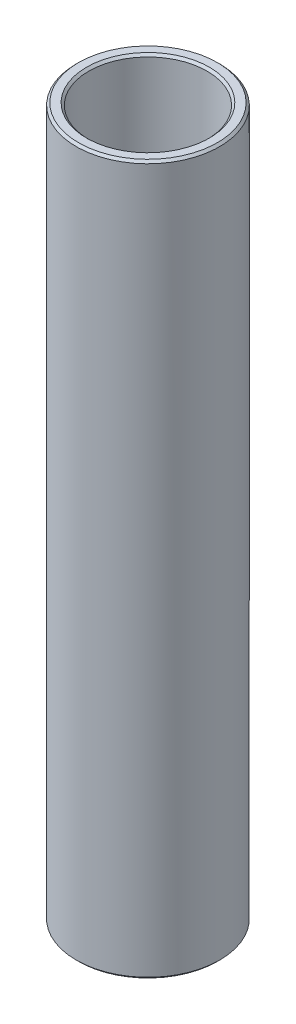
ISO-10303-21;
HEADER;
FILE_DESCRIPTION(('STEP AP214'),'2;1');
FILE_NAME('part.step','',(''),(''),'','','');
FILE_SCHEMA(('AUTOMOTIVE_DESIGN { 1 0 10303 214 1 1 1 1 }'));
ENDSEC;
DATA;
#1=APPLICATION_CONTEXT('core data for automotive mechanical design processes');
#2=APPLICATION_PROTOCOL_DEFINITION('international standard','automotive_design',2000,#1);
#3=PRODUCT_CONTEXT('',#1,'mechanical');
#4=PRODUCT('Part','Part','',(#3));
#5=PRODUCT_RELATED_PRODUCT_CATEGORY('part','',(#4));
#6=PRODUCT_DEFINITION_FORMATION('','',#4);
#7=PRODUCT_DEFINITION_CONTEXT('part definition',#1,'design');
#8=PRODUCT_DEFINITION('design','',#6,#7);
#9=PRODUCT_DEFINITION_SHAPE('','',#8);
#10=(LENGTH_UNIT() NAMED_UNIT(*) SI_UNIT(.MILLI.,.METRE.));
#11=(NAMED_UNIT(*) PLANE_ANGLE_UNIT() SI_UNIT($,.RADIAN.));
#12=(NAMED_UNIT(*) SI_UNIT($,.STERADIAN.) SOLID_ANGLE_UNIT());
#13=UNCERTAINTY_MEASURE_WITH_UNIT(LENGTH_MEASURE(1.E-05),#10,'distance_accuracy_value','');
#14=(GEOMETRIC_REPRESENTATION_CONTEXT(3) GLOBAL_UNCERTAINTY_ASSIGNED_CONTEXT((#13)) GLOBAL_UNIT_ASSIGNED_CONTEXT((#10,
#11,#12)) REPRESENTATION_CONTEXT('',''));
#15=CARTESIAN_POINT('',(0.,0.,0.));
#16=DIRECTION('',(0.,0.,1.));
#17=DIRECTION('',(1.,0.,0.));
#18=AXIS2_PLACEMENT_3D('',#15,#16,#17);
#19=CARTESIAN_POINT('',(0.,19.775,0.));
#20=DIRECTION('',(0.,1.,0.));
#21=DIRECTION('',(-1.,0.,0.));
#22=AXIS2_PLACEMENT_3D('',#19,#20,#21);
#23=CYLINDRICAL_SURFACE('',#22,3.3);
#24=CARTESIAN_POINT('',(0.,-19.648,0.));
#25=DIRECTION('',(0.,-1.,0.));
#26=DIRECTION('',(1.,0.,0.));
#27=AXIS2_PLACEMENT_3D('',#24,#25,#26);
#28=CIRCLE('',#27,3.3);
#29=CARTESIAN_POINT('',(3.3,-19.648,0.));
#30=VERTEX_POINT('',#29);
#31=EDGE_CURVE('E41',#30,#30,#28,.T.);
#32=ORIENTED_EDGE('',*,*,#31,.T.);
#33=EDGE_LOOP('',(#32));
#34=FACE_BOUND('',#33,.T.);
#35=CARTESIAN_POINT('',(0.,19.648,0.));
#36=DIRECTION('',(0.,1.,0.));
#37=DIRECTION('',(-1.,0.,0.));
#38=AXIS2_PLACEMENT_3D('',#35,#36,#37);
#39=CIRCLE('',#38,3.3);
#40=CARTESIAN_POINT('',(-3.29999999999999,19.648,0.));
#41=VERTEX_POINT('',#40);
#42=EDGE_CURVE('E45',#41,#41,#39,.T.);
#43=ORIENTED_EDGE('',*,*,#42,.T.);
#44=EDGE_LOOP('',(#43));
#45=FACE_BOUND('',#44,.T.);
#46=ADVANCED_FACE('F30',(#34,#45),#23,.F.);
#47=CARTESIAN_POINT('',(-3.3,19.775,0.));
#48=DIRECTION('',(0.,1.,0.));
#49=DIRECTION('',(-1.,0.,0.));
#50=AXIS2_PLACEMENT_3D('',#47,#48,#49);
#51=PLANE('',#50);
#52=CARTESIAN_POINT('',(0.,19.775,0.));
#53=DIRECTION('',(0.,1.,0.));
#54=DIRECTION('',(-1.,0.,0.));
#55=AXIS2_PLACEMENT_3D('',#52,#53,#54);
#56=CIRCLE('',#55,3.427);
#57=CARTESIAN_POINT('',(-3.427,19.775,0.));
#58=VERTEX_POINT('',#57);
#59=EDGE_CURVE('E10',#58,#58,#56,.F.);
#60=ORIENTED_EDGE('',*,*,#59,.T.);
#61=EDGE_LOOP('',(#60));
#62=FACE_BOUND('',#61,.T.);
#63=CARTESIAN_POINT('',(0.,19.775,0.));
#64=DIRECTION('',(0.,1.,0.));
#65=DIRECTION('',(-1.,0.,0.));
#66=AXIS2_PLACEMENT_3D('',#63,#64,#65);
#67=CIRCLE('',#66,3.873);
#68=CARTESIAN_POINT('',(-3.87299999999999,19.775,0.));
#69=VERTEX_POINT('',#68);
#70=EDGE_CURVE('E37',#69,#69,#67,.T.);
#71=ORIENTED_EDGE('',*,*,#70,.T.);
#72=EDGE_LOOP('',(#71));
#73=FACE_BOUND('',#72,.T.);
#74=ADVANCED_FACE('F74',(#62,#73),#51,.T.);
#75=CARTESIAN_POINT('',(0.,19.775,0.));
#76=DIRECTION('',(0.,1.,0.));
#77=DIRECTION('',(-1.,0.,0.));
#78=AXIS2_PLACEMENT_3D('',#75,#76,#77);
#79=CYLINDRICAL_SURFACE('',#78,4.);
#80=CARTESIAN_POINT('',(0.,-19.648,0.));
#81=DIRECTION('',(0.,-1.,0.));
#82=DIRECTION('',(1.,0.,0.));
#83=AXIS2_PLACEMENT_3D('',#80,#81,#82);
#84=CIRCLE('',#83,4.);
#85=CARTESIAN_POINT('',(4.,-19.648,0.));
#86=VERTEX_POINT('',#85);
#87=EDGE_CURVE('E56',#86,#86,#84,.F.);
#88=ORIENTED_EDGE('',*,*,#87,.T.);
#89=EDGE_LOOP('',(#88));
#90=FACE_BOUND('',#89,.T.);
#91=CARTESIAN_POINT('',(0.,19.648,0.));
#92=DIRECTION('',(0.,1.,0.));
#93=DIRECTION('',(-1.,0.,0.));
#94=AXIS2_PLACEMENT_3D('',#91,#92,#93);
#95=CIRCLE('',#94,4.);
#96=CARTESIAN_POINT('',(-3.99999999999999,19.648,0.));
#97=VERTEX_POINT('',#96);
#98=EDGE_CURVE('E59',#97,#97,#95,.F.);
#99=ORIENTED_EDGE('',*,*,#98,.T.);
#100=EDGE_LOOP('',(#99));
#101=FACE_BOUND('',#100,.T.);
#102=ADVANCED_FACE('F63',(#90,#101),#79,.T.);
#103=CARTESIAN_POINT('',(-3.99999999999999,-19.775,0.));
#104=DIRECTION('',(0.,-1.,0.));
#105=DIRECTION('',(1.,0.,0.));
#106=AXIS2_PLACEMENT_3D('',#103,#104,#105);
#107=PLANE('',#106);
#108=CARTESIAN_POINT('',(0.,-19.775,0.));
#109=DIRECTION('',(0.,-1.,0.));
#110=DIRECTION('',(1.,0.,0.));
#111=AXIS2_PLACEMENT_3D('',#108,#109,#110);
#112=CIRCLE('',#111,3.873);
#113=CARTESIAN_POINT('',(3.873,-19.775,0.));
#114=VERTEX_POINT('',#113);
#115=EDGE_CURVE('E50',#114,#114,#112,.T.);
#116=ORIENTED_EDGE('',*,*,#115,.T.);
#117=EDGE_LOOP('',(#116));
#118=FACE_BOUND('',#117,.T.);
#119=CARTESIAN_POINT('',(0.,-19.775,0.));
#120=DIRECTION('',(0.,-1.,0.));
#121=DIRECTION('',(1.,0.,0.));
#122=AXIS2_PLACEMENT_3D('',#119,#120,#121);
#123=CIRCLE('',#122,3.42699999999999);
#124=CARTESIAN_POINT('',(3.42699999999999,-19.775,0.));
#125=VERTEX_POINT('',#124);
#126=EDGE_CURVE('E53',#125,#125,#123,.F.);
#127=ORIENTED_EDGE('',*,*,#126,.T.);
#128=EDGE_LOOP('',(#127));
#129=FACE_BOUND('',#128,.T.);
#130=ADVANCED_FACE('F87',(#118,#129),#107,.T.);
#131=CARTESIAN_POINT('',(0.,-19.648,0.));
#132=DIRECTION('',(0.,1.,0.));
#133=DIRECTION('',(-1.,0.,0.));
#134=AXIS2_PLACEMENT_3D('',#131,#132,#133);
#135=CONICAL_SURFACE('',#134,4.,0.785398163397472);
#136=ORIENTED_EDGE('',*,*,#115,.F.);
#137=EDGE_LOOP('',(#136));
#138=FACE_BOUND('',#137,.T.);
#139=ORIENTED_EDGE('',*,*,#87,.F.);
#140=EDGE_LOOP('',(#139));
#141=FACE_BOUND('',#140,.T.);
#142=ADVANCED_FACE('F84',(#138,#141),#135,.T.);
#143=CARTESIAN_POINT('',(0.,-19.775,0.));
#144=DIRECTION('',(0.,-1.,0.));
#145=DIRECTION('',(1.,0.,0.));
#146=AXIS2_PLACEMENT_3D('',#143,#144,#145);
#147=CONICAL_SURFACE('',#146,3.42699999999999,0.785398163397442);
#148=ORIENTED_EDGE('',*,*,#31,.F.);
#149=EDGE_LOOP('',(#148));
#150=FACE_BOUND('',#149,.T.);
#151=ORIENTED_EDGE('',*,*,#126,.F.);
#152=EDGE_LOOP('',(#151));
#153=FACE_BOUND('',#152,.T.);
#154=ADVANCED_FACE('F71',(#150,#153),#147,.F.);
#155=CARTESIAN_POINT('',(0.,19.648,0.));
#156=DIRECTION('',(0.,1.,0.));
#157=DIRECTION('',(-1.,0.,0.));
#158=AXIS2_PLACEMENT_3D('',#155,#156,#157);
#159=CONICAL_SURFACE('',#158,3.3,0.785398163397455);
#160=ORIENTED_EDGE('',*,*,#59,.F.);
#161=EDGE_LOOP('',(#160));
#162=FACE_BOUND('',#161,.T.);
#163=ORIENTED_EDGE('',*,*,#42,.F.);
#164=EDGE_LOOP('',(#163));
#165=FACE_BOUND('',#164,.T.);
#166=ADVANCED_FACE('F67',(#162,#165),#159,.F.);
#167=CARTESIAN_POINT('',(0.,19.775,0.));
#168=DIRECTION('',(0.,-1.,0.));
#169=DIRECTION('',(1.,0.,0.));
#170=AXIS2_PLACEMENT_3D('',#167,#168,#169);
#171=CONICAL_SURFACE('',#170,3.873,0.785398163397438);
#172=ORIENTED_EDGE('',*,*,#98,.F.);
#173=EDGE_LOOP('',(#172));
#174=FACE_BOUND('',#173,.T.);
#175=ORIENTED_EDGE('',*,*,#70,.F.);
#176=EDGE_LOOP('',(#175));
#177=FACE_BOUND('',#176,.T.);
#178=ADVANCED_FACE('F32',(#174,#177),#171,.T.);
#179=CLOSED_SHELL('',(#46,#74,#102,#130,#142,#154,#166,#178));
#180=MANIFOLD_SOLID_BREP('B2',#179);
#181=ADVANCED_BREP_SHAPE_REPRESENTATION('',(#18,#180),#14);
#182=SHAPE_DEFINITION_REPRESENTATION(#9,#181);
ENDSEC;
END-ISO-10303-21;
